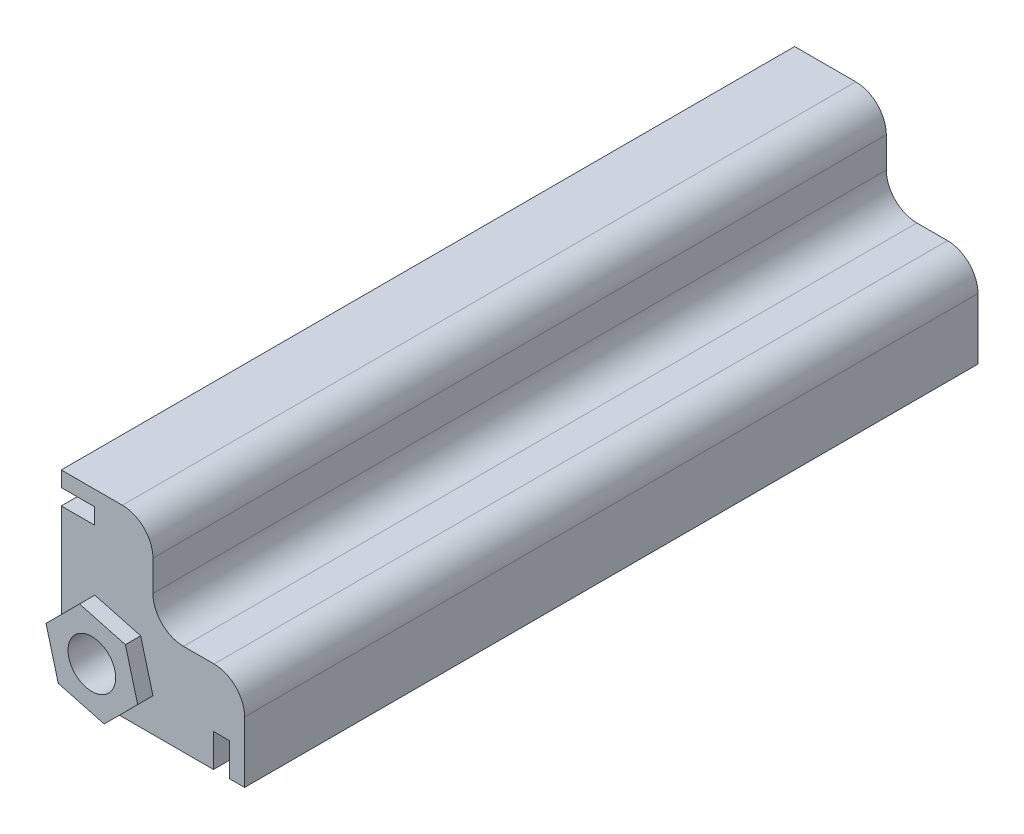
ISO-10303-21;
HEADER;
FILE_DESCRIPTION(('STEP AP214'),'2;1');
FILE_NAME('part.step','',(''),(''),'','','');
FILE_SCHEMA(('AUTOMOTIVE_DESIGN { 1 0 10303 214 1 1 1 1 }'));
ENDSEC;
DATA;
#1=APPLICATION_CONTEXT('core data for automotive mechanical design processes');
#2=APPLICATION_PROTOCOL_DEFINITION('international standard','automotive_design',2000,#1);
#3=PRODUCT_CONTEXT('',#1,'mechanical');
#4=PRODUCT('Part','Part','',(#3));
#5=PRODUCT_RELATED_PRODUCT_CATEGORY('part','',(#4));
#6=PRODUCT_DEFINITION_FORMATION('','',#4);
#7=PRODUCT_DEFINITION_CONTEXT('part definition',#1,'design');
#8=PRODUCT_DEFINITION('design','',#6,#7);
#9=PRODUCT_DEFINITION_SHAPE('','',#8);
#10=(LENGTH_UNIT() NAMED_UNIT(*) SI_UNIT(.MILLI.,.METRE.));
#11=(NAMED_UNIT(*) PLANE_ANGLE_UNIT() SI_UNIT($,.RADIAN.));
#12=(NAMED_UNIT(*) SI_UNIT($,.STERADIAN.) SOLID_ANGLE_UNIT());
#13=UNCERTAINTY_MEASURE_WITH_UNIT(LENGTH_MEASURE(1.E-05),#10,'distance_accuracy_value','');
#14=(GEOMETRIC_REPRESENTATION_CONTEXT(3) GLOBAL_UNCERTAINTY_ASSIGNED_CONTEXT((#13)) GLOBAL_UNIT_ASSIGNED_CONTEXT((#10,
#11,#12)) REPRESENTATION_CONTEXT('',''));
#15=CARTESIAN_POINT('',(0.,0.,0.));
#16=DIRECTION('',(0.,0.,1.));
#17=DIRECTION('',(1.,0.,0.));
#18=AXIS2_PLACEMENT_3D('',#15,#16,#17);
#19=CARTESIAN_POINT('',(0.,0.,152.4));
#20=DIRECTION('',(0.,0.,-1.));
#21=DIRECTION('',(-1.,0.,0.));
#22=AXIS2_PLACEMENT_3D('',#19,#20,#21);
#23=PLANE('',#22);
#24=DIRECTION('',(0.,1.,0.));
#25=VECTOR('',#24,1.);
#26=CARTESIAN_POINT('',(38.1,19.05,152.4));
#27=LINE('',#26,#25);
#28=CARTESIAN_POINT('',(38.1,0.,152.4));
#29=VERTEX_POINT('',#28);
#30=CARTESIAN_POINT('',(38.1,12.7,152.4));
#31=VERTEX_POINT('',#30);
#32=EDGE_CURVE('E309',#29,#31,#27,.T.);
#33=ORIENTED_EDGE('',*,*,#32,.T.);
#34=CARTESIAN_POINT('',(31.75,12.7,152.4));
#35=DIRECTION('',(0.,0.,-1.));
#36=DIRECTION('',(-1.,0.,0.));
#37=AXIS2_PLACEMENT_3D('',#34,#35,#36);
#38=CIRCLE('',#37,6.35);
#39=CARTESIAN_POINT('',(31.75,19.05,152.4));
#40=VERTEX_POINT('',#39);
#41=EDGE_CURVE('E389',#31,#40,#38,.F.);
#42=ORIENTED_EDGE('',*,*,#41,.T.);
#43=DIRECTION('',(-1.,0.,0.));
#44=VECTOR('',#43,1.);
#45=CARTESIAN_POINT('',(19.05,19.05,152.4));
#46=LINE('',#45,#44);
#47=CARTESIAN_POINT('',(25.4,19.05,152.4));
#48=VERTEX_POINT('',#47);
#49=EDGE_CURVE('E314',#40,#48,#46,.T.);
#50=ORIENTED_EDGE('',*,*,#49,.T.);
#51=CARTESIAN_POINT('',(25.4,25.4,152.4));
#52=DIRECTION('',(0.,0.,-1.));
#53=DIRECTION('',(-1.,0.,0.));
#54=AXIS2_PLACEMENT_3D('',#51,#52,#53);
#55=CIRCLE('',#54,6.35);
#56=CARTESIAN_POINT('',(19.05,25.4,152.4));
#57=VERTEX_POINT('',#56);
#58=EDGE_CURVE('E11',#48,#57,#55,.T.);
#59=ORIENTED_EDGE('',*,*,#58,.T.);
#60=DIRECTION('',(0.,1.,0.));
#61=VECTOR('',#60,1.);
#62=CARTESIAN_POINT('',(19.05,38.1,152.4));
#63=LINE('',#62,#61);
#64=CARTESIAN_POINT('',(19.05,31.75,152.4));
#65=VERTEX_POINT('',#64);
#66=EDGE_CURVE('E318',#57,#65,#63,.T.);
#67=ORIENTED_EDGE('',*,*,#66,.T.);
#68=CARTESIAN_POINT('',(12.7,31.75,152.4));
#69=DIRECTION('',(0.,0.,-1.));
#70=DIRECTION('',(-1.,0.,0.));
#71=AXIS2_PLACEMENT_3D('',#68,#69,#70);
#72=CIRCLE('',#71,6.35);
#73=CARTESIAN_POINT('',(12.7,38.1,152.4));
#74=VERTEX_POINT('',#73);
#75=EDGE_CURVE('E55',#65,#74,#72,.F.);
#76=ORIENTED_EDGE('',*,*,#75,.T.);
#77=DIRECTION('',(-1.,0.,0.));
#78=VECTOR('',#77,1.);
#79=CARTESIAN_POINT('',(0.,38.1,152.4));
#80=LINE('',#79,#78);
#81=CARTESIAN_POINT('',(0.,38.1,152.4));
#82=VERTEX_POINT('',#81);
#83=EDGE_CURVE('E321',#74,#82,#80,.T.);
#84=ORIENTED_EDGE('',*,*,#83,.T.);
#85=DIRECTION('',(0.,-1.,0.));
#86=VECTOR('',#85,1.);
#87=CARTESIAN_POINT('',(0.,0.,152.4));
#88=LINE('',#87,#86);
#89=CARTESIAN_POINT('',(0.,34.925,152.4));
#90=VERTEX_POINT('',#89);
#91=EDGE_CURVE('E325',#82,#90,#88,.T.);
#92=ORIENTED_EDGE('',*,*,#91,.T.);
#93=DIRECTION('',(-1.,0.,0.));
#94=VECTOR('',#93,1.);
#95=CARTESIAN_POINT('',(0.,34.925,152.4));
#96=LINE('',#95,#94);
#97=CARTESIAN_POINT('',(6.858,34.925,152.4));
#98=VERTEX_POINT('',#97);
#99=EDGE_CURVE('E241',#98,#90,#96,.T.);
#100=ORIENTED_EDGE('',*,*,#99,.F.);
#101=DIRECTION('',(0.,1.,0.));
#102=VECTOR('',#101,1.);
#103=CARTESIAN_POINT('',(6.858,34.925,152.4));
#104=LINE('',#103,#102);
#105=CARTESIAN_POINT('',(6.858,31.623,152.4));
#106=VERTEX_POINT('',#105);
#107=EDGE_CURVE('E254',#106,#98,#104,.T.);
#108=ORIENTED_EDGE('',*,*,#107,.F.);
#109=DIRECTION('',(1.,0.,0.));
#110=VECTOR('',#109,1.);
#111=CARTESIAN_POINT('',(0.,31.623,152.4));
#112=LINE('',#111,#110);
#113=CARTESIAN_POINT('',(0.,31.623,152.4));
#114=VERTEX_POINT('',#113);
#115=EDGE_CURVE('E250',#114,#106,#112,.T.);
#116=ORIENTED_EDGE('',*,*,#115,.F.);
#117=CARTESIAN_POINT('',(0.,12.0772160579064,152.4));
#118=VERTEX_POINT('',#117);
#119=EDGE_CURVE('E330',#114,#118,#88,.T.);
#120=ORIENTED_EDGE('',*,*,#119,.T.);
#121=DIRECTION('',(-0.707106781186547,-0.707106781186548,0.));
#122=VECTOR('',#121,1.);
#123=CARTESIAN_POINT('',(6.97278394209356,19.05,152.4));
#124=LINE('',#123,#122);
#125=CARTESIAN_POINT('',(6.97278394209356,19.05,152.4));
#126=VERTEX_POINT('',#125);
#127=EDGE_CURVE('E735',#126,#118,#124,.T.);
#128=ORIENTED_EDGE('',*,*,#127,.F.);
#129=DIRECTION('',(-0.965925826289068,0.258819045102521,0.));
#130=VECTOR('',#129,1.);
#131=CARTESIAN_POINT('',(16.4977839420936,16.4977839420936,152.4));
#132=LINE('',#131,#130);
#133=CARTESIAN_POINT('',(16.4977839420936,16.4977839420936,152.4));
#134=VERTEX_POINT('',#133);
#135=EDGE_CURVE('E732',#134,#126,#132,.T.);
#136=ORIENTED_EDGE('',*,*,#135,.F.);
#137=DIRECTION('',(-0.258819045102521,0.965925826289068,0.));
#138=VECTOR('',#137,1.);
#139=CARTESIAN_POINT('',(19.05,6.97278394209356,152.4));
#140=LINE('',#139,#138);
#141=CARTESIAN_POINT('',(19.05,6.97278394209356,152.4));
#142=VERTEX_POINT('',#141);
#143=EDGE_CURVE('E223',#142,#134,#140,.T.);
#144=ORIENTED_EDGE('',*,*,#143,.F.);
#145=DIRECTION('',(0.707106781186547,0.707106781186548,0.));
#146=VECTOR('',#145,1.);
#147=CARTESIAN_POINT('',(12.0772160579064,0.,152.4));
#148=LINE('',#147,#146);
#149=CARTESIAN_POINT('',(12.0772160579065,0.,152.4));
#150=VERTEX_POINT('',#149);
#151=EDGE_CURVE('E220',#150,#142,#148,.T.);
#152=ORIENTED_EDGE('',*,*,#151,.F.);
#153=DIRECTION('',(1.,0.,0.));
#154=VECTOR('',#153,1.);
#155=CARTESIAN_POINT('',(38.1,0.,152.4));
#156=LINE('',#155,#154);
#157=CARTESIAN_POINT('',(31.623,0.,152.4));
#158=VERTEX_POINT('',#157);
#159=EDGE_CURVE('E310',#150,#158,#156,.T.);
#160=ORIENTED_EDGE('',*,*,#159,.T.);
#161=DIRECTION('',(0.,-1.,0.));
#162=VECTOR('',#161,1.);
#163=CARTESIAN_POINT('',(31.623,0.,152.4));
#164=LINE('',#163,#162);
#165=CARTESIAN_POINT('',(31.623,6.858,152.4));
#166=VERTEX_POINT('',#165);
#167=EDGE_CURVE('E279',#166,#158,#164,.T.);
#168=ORIENTED_EDGE('',*,*,#167,.F.);
#169=DIRECTION('',(-1.,0.,0.));
#170=VECTOR('',#169,1.);
#171=CARTESIAN_POINT('',(34.925,6.858,152.4));
#172=LINE('',#171,#170);
#173=CARTESIAN_POINT('',(34.925,6.858,152.4));
#174=VERTEX_POINT('',#173);
#175=EDGE_CURVE('E230',#174,#166,#172,.T.);
#176=ORIENTED_EDGE('',*,*,#175,.F.);
#177=DIRECTION('',(0.,1.,0.));
#178=VECTOR('',#177,1.);
#179=CARTESIAN_POINT('',(34.925,0.,152.4));
#180=LINE('',#179,#178);
#181=CARTESIAN_POINT('',(34.925,0.,152.4));
#182=VERTEX_POINT('',#181);
#183=EDGE_CURVE('E225',#182,#174,#180,.T.);
#184=ORIENTED_EDGE('',*,*,#183,.F.);
#185=EDGE_CURVE('E311',#182,#29,#156,.T.);
#186=ORIENTED_EDGE('',*,*,#185,.T.);
#187=EDGE_LOOP('',(#33,#42,#50,#59,#67,#76,#84,#92,#100,#108,#116,#120,#128,#136,#144,#152,#160,
#168,#176,#184,#186));
#188=FACE_BOUND('',#187,.T.);
#189=ADVANCED_FACE('F39',(#188),#23,.F.);
#190=DIRECTION('',(0.965925826289068,-0.258819045102521,0.));
#191=VECTOR('',#190,1.);
#192=CARTESIAN_POINT('',(2.55221605790646,2.55221605790644,152.4));
#193=LINE('',#192,#191);
#194=CARTESIAN_POINT('',(2.55221605790646,2.55221605790644,152.4));
#195=VERTEX_POINT('',#194);
#196=EDGE_CURVE('E740',#195,#150,#193,.T.);
#197=ORIENTED_EDGE('',*,*,#196,.F.);
#198=DIRECTION('',(0.258819045102521,-0.965925826289068,0.));
#199=VECTOR('',#198,1.);
#200=CARTESIAN_POINT('',(0.,12.0772160579064,152.4));
#201=LINE('',#200,#199);
#202=EDGE_CURVE('E450',#118,#195,#201,.T.);
#203=ORIENTED_EDGE('',*,*,#202,.F.);
#204=CARTESIAN_POINT('',(0.,0.,152.4));
#205=VERTEX_POINT('',#204);
#206=EDGE_CURVE('E324',#118,#205,#88,.T.);
#207=ORIENTED_EDGE('',*,*,#206,.T.);
#208=EDGE_CURVE('E305',#205,#150,#156,.T.);
#209=ORIENTED_EDGE('',*,*,#208,.T.);
#210=EDGE_LOOP('',(#197,#203,#207,#209));
#211=FACE_BOUND('',#210,.T.);
#212=ADVANCED_FACE('F446',(#211),#23,.F.);
#213=CARTESIAN_POINT('',(38.1,0.,152.4));
#214=DIRECTION('',(0.,1.,0.));
#215=DIRECTION('',(-1.,0.,0.));
#216=AXIS2_PLACEMENT_3D('',#213,#214,#215);
#217=PLANE('',#216);
#218=ORIENTED_EDGE('',*,*,#185,.F.);
#219=DIRECTION('',(0.,0.,1.));
#220=VECTOR('',#219,1.);
#221=CARTESIAN_POINT('',(34.925,0.,0.));
#222=LINE('',#221,#220);
#223=CARTESIAN_POINT('',(34.925,0.,0.));
#224=VERTEX_POINT('',#223);
#225=EDGE_CURVE('E255',#224,#182,#222,.T.);
#226=ORIENTED_EDGE('',*,*,#225,.F.);
#227=DIRECTION('',(1.,0.,0.));
#228=VECTOR('',#227,1.);
#229=CARTESIAN_POINT('',(38.1,0.,0.));
#230=LINE('',#229,#228);
#231=CARTESIAN_POINT('',(38.1,0.,0.));
#232=VERTEX_POINT('',#231);
#233=EDGE_CURVE('E265',#224,#232,#230,.T.);
#234=ORIENTED_EDGE('',*,*,#233,.T.);
#235=DIRECTION('',(0.,0.,-1.));
#236=VECTOR('',#235,1.);
#237=CARTESIAN_POINT('',(38.1,0.,152.4));
#238=LINE('',#237,#236);
#239=EDGE_CURVE('E361',#29,#232,#238,.T.);
#240=ORIENTED_EDGE('',*,*,#239,.F.);
#241=EDGE_LOOP('',(#218,#226,#234,#240));
#242=FACE_BOUND('',#241,.T.);
#243=ADVANCED_FACE('F466',(#242),#217,.F.);
#244=CARTESIAN_POINT('',(0.,0.,152.4));
#245=DIRECTION('',(1.,0.,0.));
#246=DIRECTION('',(0.,0.,-1.));
#247=AXIS2_PLACEMENT_3D('',#244,#245,#246);
#248=PLANE('',#247);
#249=DIRECTION('',(0.,-1.,0.));
#250=VECTOR('',#249,1.);
#251=CARTESIAN_POINT('',(0.,0.,0.));
#252=LINE('',#251,#250);
#253=CARTESIAN_POINT('',(0.,38.1,0.));
#254=VERTEX_POINT('',#253);
#255=CARTESIAN_POINT('',(0.,34.925,0.));
#256=VERTEX_POINT('',#255);
#257=EDGE_CURVE('E350',#254,#256,#252,.T.);
#258=ORIENTED_EDGE('',*,*,#257,.T.);
#259=DIRECTION('',(0.,0.,1.));
#260=VECTOR('',#259,1.);
#261=CARTESIAN_POINT('',(0.,34.925,0.));
#262=LINE('',#261,#260);
#263=EDGE_CURVE('E261',#256,#90,#262,.T.);
#264=ORIENTED_EDGE('',*,*,#263,.T.);
#265=ORIENTED_EDGE('',*,*,#91,.F.);
#266=DIRECTION('',(0.,0.,-1.));
#267=VECTOR('',#266,1.);
#268=CARTESIAN_POINT('',(0.,38.1,152.4));
#269=LINE('',#268,#267);
#270=EDGE_CURVE('E357',#82,#254,#269,.T.);
#271=ORIENTED_EDGE('',*,*,#270,.T.);
#272=EDGE_LOOP('',(#258,#264,#265,#271));
#273=FACE_BOUND('',#272,.T.);
#274=ADVANCED_FACE('F422',(#273),#248,.F.);
#275=CARTESIAN_POINT('',(0.,0.,0.));
#276=VERTEX_POINT('',#275);
#277=CARTESIAN_POINT('',(31.623,0.,0.));
#278=VERTEX_POINT('',#277);
#279=EDGE_CURVE('E331',#276,#278,#230,.T.);
#280=ORIENTED_EDGE('',*,*,#279,.T.);
#281=DIRECTION('',(0.,0.,1.));
#282=VECTOR('',#281,1.);
#283=CARTESIAN_POINT('',(31.623,0.,0.));
#284=LINE('',#283,#282);
#285=EDGE_CURVE('E296',#278,#158,#284,.T.);
#286=ORIENTED_EDGE('',*,*,#285,.T.);
#287=ORIENTED_EDGE('',*,*,#159,.F.);
#288=ORIENTED_EDGE('',*,*,#208,.F.);
#289=DIRECTION('',(0.,0.,-1.));
#290=VECTOR('',#289,1.);
#291=CARTESIAN_POINT('',(0.,0.,152.4));
#292=LINE('',#291,#290);
#293=EDGE_CURVE('E329',#205,#276,#292,.T.);
#294=ORIENTED_EDGE('',*,*,#293,.T.);
#295=EDGE_LOOP('',(#280,#286,#287,#288,#294));
#296=FACE_BOUND('',#295,.T.);
#297=ADVANCED_FACE('F454',(#296),#217,.F.);
#298=CARTESIAN_POINT('',(38.1,19.05,152.4));
#299=DIRECTION('',(-1.,0.,0.));
#300=DIRECTION('',(0.,-1.,0.));
#301=AXIS2_PLACEMENT_3D('',#298,#299,#300);
#302=PLANE('',#301);
#303=DIRECTION('',(0.,1.,0.));
#304=VECTOR('',#303,1.);
#305=CARTESIAN_POINT('',(38.1,19.05,0.));
#306=LINE('',#305,#304);
#307=CARTESIAN_POINT('',(38.1,12.7,0.));
#308=VERTEX_POINT('',#307);
#309=EDGE_CURVE('E335',#232,#308,#306,.T.);
#310=ORIENTED_EDGE('',*,*,#309,.T.);
#311=DIRECTION('',(0.,0.,-1.));
#312=VECTOR('',#311,1.);
#313=CARTESIAN_POINT('',(38.1,12.7,152.4));
#314=LINE('',#313,#312);
#315=EDGE_CURVE('E63',#308,#31,#314,.F.);
#316=ORIENTED_EDGE('',*,*,#315,.T.);
#317=ORIENTED_EDGE('',*,*,#32,.F.);
#318=ORIENTED_EDGE('',*,*,#239,.T.);
#319=EDGE_LOOP('',(#310,#316,#317,#318));
#320=FACE_BOUND('',#319,.T.);
#321=ADVANCED_FACE('F465',(#320),#302,.F.);
#322=CARTESIAN_POINT('',(19.05,19.05,152.4));
#323=DIRECTION('',(0.,-1.,0.));
#324=DIRECTION('',(0.,0.,-1.));
#325=AXIS2_PLACEMENT_3D('',#322,#323,#324);
#326=PLANE('',#325);
#327=DIRECTION('',(-1.,0.,0.));
#328=VECTOR('',#327,1.);
#329=CARTESIAN_POINT('',(19.05,19.05,0.));
#330=LINE('',#329,#328);
#331=CARTESIAN_POINT('',(31.75,19.05,0.));
#332=VERTEX_POINT('',#331);
#333=CARTESIAN_POINT('',(25.4,19.05,0.));
#334=VERTEX_POINT('',#333);
#335=EDGE_CURVE('E338',#332,#334,#330,.T.);
#336=ORIENTED_EDGE('',*,*,#335,.T.);
#337=DIRECTION('',(0.,0.,-1.));
#338=VECTOR('',#337,1.);
#339=CARTESIAN_POINT('',(25.4,19.05,152.4));
#340=LINE('',#339,#338);
#341=EDGE_CURVE('E376',#334,#48,#340,.F.);
#342=ORIENTED_EDGE('',*,*,#341,.T.);
#343=ORIENTED_EDGE('',*,*,#49,.F.);
#344=DIRECTION('',(0.,0.,-1.));
#345=VECTOR('',#344,1.);
#346=CARTESIAN_POINT('',(31.75,19.05,152.4));
#347=LINE('',#346,#345);
#348=EDGE_CURVE('E372',#40,#332,#347,.T.);
#349=ORIENTED_EDGE('',*,*,#348,.T.);
#350=EDGE_LOOP('',(#336,#342,#343,#349));
#351=FACE_BOUND('',#350,.T.);
#352=ADVANCED_FACE('F404',(#351),#326,.F.);
#353=CARTESIAN_POINT('',(19.05,38.1,152.4));
#354=DIRECTION('',(-1.,0.,0.));
#355=DIRECTION('',(0.,-1.,0.));
#356=AXIS2_PLACEMENT_3D('',#353,#354,#355);
#357=PLANE('',#356);
#358=ORIENTED_EDGE('',*,*,#66,.F.);
#359=DIRECTION('',(0.,0.,-1.));
#360=VECTOR('',#359,1.);
#361=CARTESIAN_POINT('',(19.05,25.4,0.));
#362=LINE('',#361,#360);
#363=CARTESIAN_POINT('',(19.05,25.4,0.));
#364=VERTEX_POINT('',#363);
#365=EDGE_CURVE('E368',#57,#364,#362,.T.);
#366=ORIENTED_EDGE('',*,*,#365,.T.);
#367=DIRECTION('',(0.,1.,0.));
#368=VECTOR('',#367,1.);
#369=CARTESIAN_POINT('',(19.05,38.1,0.));
#370=LINE('',#369,#368);
#371=CARTESIAN_POINT('',(19.05,31.75,0.));
#372=VERTEX_POINT('',#371);
#373=EDGE_CURVE('E342',#364,#372,#370,.T.);
#374=ORIENTED_EDGE('',*,*,#373,.T.);
#375=DIRECTION('',(0.,0.,-1.));
#376=VECTOR('',#375,1.);
#377=CARTESIAN_POINT('',(19.05,31.75,152.4));
#378=LINE('',#377,#376);
#379=EDGE_CURVE('E365',#372,#65,#378,.F.);
#380=ORIENTED_EDGE('',*,*,#379,.T.);
#381=EDGE_LOOP('',(#358,#366,#374,#380));
#382=FACE_BOUND('',#381,.T.);
#383=ADVANCED_FACE('F411',(#382),#357,.F.);
#384=CARTESIAN_POINT('',(0.,38.1,152.4));
#385=DIRECTION('',(0.,-1.,0.));
#386=DIRECTION('',(0.,0.,-1.));
#387=AXIS2_PLACEMENT_3D('',#384,#385,#386);
#388=PLANE('',#387);
#389=ORIENTED_EDGE('',*,*,#83,.F.);
#390=DIRECTION('',(0.,0.,-1.));
#391=VECTOR('',#390,1.);
#392=CARTESIAN_POINT('',(12.7,38.1,152.4));
#393=LINE('',#392,#391);
#394=CARTESIAN_POINT('',(12.7,38.1,0.));
#395=VERTEX_POINT('',#394);
#396=EDGE_CURVE('E392',#74,#395,#393,.T.);
#397=ORIENTED_EDGE('',*,*,#396,.T.);
#398=DIRECTION('',(-1.,0.,0.));
#399=VECTOR('',#398,1.);
#400=CARTESIAN_POINT('',(0.,38.1,0.));
#401=LINE('',#400,#399);
#402=EDGE_CURVE('E346',#395,#254,#401,.T.);
#403=ORIENTED_EDGE('',*,*,#402,.T.);
#404=ORIENTED_EDGE('',*,*,#270,.F.);
#405=EDGE_LOOP('',(#389,#397,#403,#404));
#406=FACE_BOUND('',#405,.T.);
#407=ADVANCED_FACE('F417',(#406),#388,.F.);
#408=ORIENTED_EDGE('',*,*,#119,.F.);
#409=DIRECTION('',(0.,0.,1.));
#410=VECTOR('',#409,1.);
#411=CARTESIAN_POINT('',(0.,31.623,0.));
#412=LINE('',#411,#410);
#413=CARTESIAN_POINT('',(0.,31.623,0.));
#414=VERTEX_POINT('',#413);
#415=EDGE_CURVE('E249',#414,#114,#412,.T.);
#416=ORIENTED_EDGE('',*,*,#415,.F.);
#417=EDGE_CURVE('E349',#414,#276,#252,.T.);
#418=ORIENTED_EDGE('',*,*,#417,.T.);
#419=ORIENTED_EDGE('',*,*,#293,.F.);
#420=ORIENTED_EDGE('',*,*,#206,.F.);
#421=EDGE_LOOP('',(#408,#416,#418,#419,#420));
#422=FACE_BOUND('',#421,.T.);
#423=ADVANCED_FACE('F440',(#422),#248,.F.);
#424=CARTESIAN_POINT('',(0.,0.,0.));
#425=DIRECTION('',(0.,0.,-1.));
#426=DIRECTION('',(-1.,0.,0.));
#427=AXIS2_PLACEMENT_3D('',#424,#425,#426);
#428=PLANE('',#427);
#429=CARTESIAN_POINT('',(9.525,9.525,0.));
#430=DIRECTION('',(0.,0.,1.));
#431=DIRECTION('',(1.,0.,0.));
#432=AXIS2_PLACEMENT_3D('',#429,#430,#431);
#433=CIRCLE('',#432,4.953);
#434=CARTESIAN_POINT('',(14.478,9.525,0.));
#435=VERTEX_POINT('',#434);
#436=EDGE_CURVE('E710',#435,#435,#433,.T.);
#437=ORIENTED_EDGE('',*,*,#436,.T.);
#438=EDGE_LOOP('',(#437));
#439=FACE_BOUND('',#438,.T.);
#440=ORIENTED_EDGE('',*,*,#335,.F.);
#441=CARTESIAN_POINT('',(31.75,12.7,0.));
#442=DIRECTION('',(0.,0.,-1.));
#443=DIRECTION('',(-1.,0.,0.));
#444=AXIS2_PLACEMENT_3D('',#441,#442,#443);
#445=CIRCLE('',#444,6.35);
#446=EDGE_CURVE('E382',#332,#308,#445,.T.);
#447=ORIENTED_EDGE('',*,*,#446,.T.);
#448=ORIENTED_EDGE('',*,*,#309,.F.);
#449=ORIENTED_EDGE('',*,*,#233,.F.);
#450=DIRECTION('',(0.,1.,0.));
#451=VECTOR('',#450,1.);
#452=CARTESIAN_POINT('',(34.925,0.,0.));
#453=LINE('',#452,#451);
#454=CARTESIAN_POINT('',(34.925,6.858,0.));
#455=VERTEX_POINT('',#454);
#456=EDGE_CURVE('E274',#224,#455,#453,.T.);
#457=ORIENTED_EDGE('',*,*,#456,.T.);
#458=DIRECTION('',(-1.,0.,0.));
#459=VECTOR('',#458,1.);
#460=CARTESIAN_POINT('',(34.925,6.858,0.));
#461=LINE('',#460,#459);
#462=CARTESIAN_POINT('',(31.623,6.858,0.));
#463=VERTEX_POINT('',#462);
#464=EDGE_CURVE('E278',#455,#463,#461,.T.);
#465=ORIENTED_EDGE('',*,*,#464,.T.);
#466=DIRECTION('',(0.,-1.,0.));
#467=VECTOR('',#466,1.);
#468=CARTESIAN_POINT('',(31.623,0.,0.));
#469=LINE('',#468,#467);
#470=EDGE_CURVE('E283',#463,#278,#469,.T.);
#471=ORIENTED_EDGE('',*,*,#470,.T.);
#472=ORIENTED_EDGE('',*,*,#279,.F.);
#473=ORIENTED_EDGE('',*,*,#417,.F.);
#474=DIRECTION('',(1.,0.,0.));
#475=VECTOR('',#474,1.);
#476=CARTESIAN_POINT('',(0.,31.623,0.));
#477=LINE('',#476,#475);
#478=CARTESIAN_POINT('',(6.858,31.623,0.));
#479=VERTEX_POINT('',#478);
#480=EDGE_CURVE('E236',#414,#479,#477,.T.);
#481=ORIENTED_EDGE('',*,*,#480,.T.);
#482=DIRECTION('',(0.,1.,0.));
#483=VECTOR('',#482,1.);
#484=CARTESIAN_POINT('',(6.858,34.925,0.));
#485=LINE('',#484,#483);
#486=CARTESIAN_POINT('',(6.858,34.925,0.));
#487=VERTEX_POINT('',#486);
#488=EDGE_CURVE('E240',#479,#487,#485,.T.);
#489=ORIENTED_EDGE('',*,*,#488,.T.);
#490=DIRECTION('',(-1.,0.,0.));
#491=VECTOR('',#490,1.);
#492=CARTESIAN_POINT('',(0.,34.925,0.));
#493=LINE('',#492,#491);
#494=EDGE_CURVE('E245',#487,#256,#493,.T.);
#495=ORIENTED_EDGE('',*,*,#494,.T.);
#496=ORIENTED_EDGE('',*,*,#257,.F.);
#497=ORIENTED_EDGE('',*,*,#402,.F.);
#498=CARTESIAN_POINT('',(12.7,31.75,0.));
#499=DIRECTION('',(0.,0.,-1.));
#500=DIRECTION('',(-1.,0.,0.));
#501=AXIS2_PLACEMENT_3D('',#498,#499,#500);
#502=CIRCLE('',#501,6.35);
#503=EDGE_CURVE('E379',#395,#372,#502,.T.);
#504=ORIENTED_EDGE('',*,*,#503,.T.);
#505=ORIENTED_EDGE('',*,*,#373,.F.);
#506=CARTESIAN_POINT('',(25.4,25.4,0.));
#507=DIRECTION('',(0.,0.,-1.));
#508=DIRECTION('',(-1.,0.,0.));
#509=AXIS2_PLACEMENT_3D('',#506,#507,#508);
#510=CIRCLE('',#509,6.35);
#511=EDGE_CURVE('E48',#364,#334,#510,.F.);
#512=ORIENTED_EDGE('',*,*,#511,.T.);
#513=EDGE_LOOP('',(#440,#447,#448,#449,#457,#465,#471,#472,#473,#481,#489,#495,#496,#497,#504,
#505,#512));
#514=FACE_BOUND('',#513,.T.);
#515=ADVANCED_FACE('F399',(#439,#514),#428,.T.);
#516=CARTESIAN_POINT('',(34.925,0.,0.));
#517=DIRECTION('',(1.,0.,0.));
#518=DIRECTION('',(0.,0.,-1.));
#519=AXIS2_PLACEMENT_3D('',#516,#517,#518);
#520=PLANE('',#519);
#521=ORIENTED_EDGE('',*,*,#183,.T.);
#522=DIRECTION('',(0.,0.,1.));
#523=VECTOR('',#522,1.);
#524=CARTESIAN_POINT('',(34.925,6.858,0.));
#525=LINE('',#524,#523);
#526=EDGE_CURVE('E286',#455,#174,#525,.T.);
#527=ORIENTED_EDGE('',*,*,#526,.F.);
#528=ORIENTED_EDGE('',*,*,#456,.F.);
#529=ORIENTED_EDGE('',*,*,#225,.T.);
#530=EDGE_LOOP('',(#521,#527,#528,#529));
#531=FACE_BOUND('',#530,.T.);
#532=ADVANCED_FACE('F486',(#531),#520,.F.);
#533=CARTESIAN_POINT('',(31.623,0.,0.));
#534=DIRECTION('',(-1.,0.,0.));
#535=DIRECTION('',(0.,0.,1.));
#536=AXIS2_PLACEMENT_3D('',#533,#534,#535);
#537=PLANE('',#536);
#538=ORIENTED_EDGE('',*,*,#167,.T.);
#539=ORIENTED_EDGE('',*,*,#285,.F.);
#540=ORIENTED_EDGE('',*,*,#470,.F.);
#541=DIRECTION('',(0.,0.,1.));
#542=VECTOR('',#541,1.);
#543=CARTESIAN_POINT('',(31.623,6.858,0.));
#544=LINE('',#543,#542);
#545=EDGE_CURVE('E300',#463,#166,#544,.T.);
#546=ORIENTED_EDGE('',*,*,#545,.T.);
#547=EDGE_LOOP('',(#538,#539,#540,#546));
#548=FACE_BOUND('',#547,.T.);
#549=ADVANCED_FACE('F524',(#548),#537,.F.);
#550=CARTESIAN_POINT('',(34.925,6.858,0.));
#551=DIRECTION('',(0.,1.,0.));
#552=DIRECTION('',(-1.,0.,0.));
#553=AXIS2_PLACEMENT_3D('',#550,#551,#552);
#554=PLANE('',#553);
#555=ORIENTED_EDGE('',*,*,#175,.T.);
#556=ORIENTED_EDGE('',*,*,#545,.F.);
#557=ORIENTED_EDGE('',*,*,#464,.F.);
#558=ORIENTED_EDGE('',*,*,#526,.T.);
#559=EDGE_LOOP('',(#555,#556,#557,#558));
#560=FACE_BOUND('',#559,.T.);
#561=ADVANCED_FACE('F533',(#560),#554,.F.);
#562=CARTESIAN_POINT('',(0.,34.925,0.));
#563=DIRECTION('',(0.,1.,0.));
#564=DIRECTION('',(0.,0.,1.));
#565=AXIS2_PLACEMENT_3D('',#562,#563,#564);
#566=PLANE('',#565);
#567=ORIENTED_EDGE('',*,*,#99,.T.);
#568=ORIENTED_EDGE('',*,*,#263,.F.);
#569=ORIENTED_EDGE('',*,*,#494,.F.);
#570=DIRECTION('',(0.,0.,1.));
#571=VECTOR('',#570,1.);
#572=CARTESIAN_POINT('',(6.858,34.925,0.));
#573=LINE('',#572,#571);
#574=EDGE_CURVE('E266',#487,#98,#573,.T.);
#575=ORIENTED_EDGE('',*,*,#574,.T.);
#576=EDGE_LOOP('',(#567,#568,#569,#575));
#577=FACE_BOUND('',#576,.T.);
#578=ADVANCED_FACE('F428',(#577),#566,.F.);
#579=CARTESIAN_POINT('',(6.858,34.925,0.));
#580=DIRECTION('',(1.,0.,0.));
#581=DIRECTION('',(0.,1.,0.));
#582=AXIS2_PLACEMENT_3D('',#579,#580,#581);
#583=PLANE('',#582);
#584=ORIENTED_EDGE('',*,*,#107,.T.);
#585=ORIENTED_EDGE('',*,*,#574,.F.);
#586=ORIENTED_EDGE('',*,*,#488,.F.);
#587=DIRECTION('',(0.,0.,1.));
#588=VECTOR('',#587,1.);
#589=CARTESIAN_POINT('',(6.858,31.623,0.));
#590=LINE('',#589,#588);
#591=EDGE_CURVE('E269',#479,#106,#590,.T.);
#592=ORIENTED_EDGE('',*,*,#591,.T.);
#593=EDGE_LOOP('',(#584,#585,#586,#592));
#594=FACE_BOUND('',#593,.T.);
#595=ADVANCED_FACE('F430',(#594),#583,.F.);
#596=CARTESIAN_POINT('',(0.,31.623,0.));
#597=DIRECTION('',(0.,-1.,0.));
#598=DIRECTION('',(0.,0.,-1.));
#599=AXIS2_PLACEMENT_3D('',#596,#597,#598);
#600=PLANE('',#599);
#601=ORIENTED_EDGE('',*,*,#115,.T.);
#602=ORIENTED_EDGE('',*,*,#591,.F.);
#603=ORIENTED_EDGE('',*,*,#480,.F.);
#604=ORIENTED_EDGE('',*,*,#415,.T.);
#605=EDGE_LOOP('',(#601,#602,#603,#604));
#606=FACE_BOUND('',#605,.T.);
#607=ADVANCED_FACE('F433',(#606),#600,.F.);
#608=CARTESIAN_POINT('',(19.05,6.97278394209356,155.575));
#609=DIRECTION('',(-0.965925826289068,-0.258819045102521,0.));
#610=DIRECTION('',(0.258819045102521,-0.965925826289068,0.));
#611=AXIS2_PLACEMENT_3D('',#608,#609,#610);
#612=PLANE('',#611);
#613=ORIENTED_EDGE('',*,*,#143,.T.);
#614=DIRECTION('',(0.,0.,-1.));
#615=VECTOR('',#614,1.);
#616=CARTESIAN_POINT('',(16.4977839420936,16.4977839420936,155.575));
#617=LINE('',#616,#615);
#618=CARTESIAN_POINT('',(16.4977839420936,16.4977839420936,155.575));
#619=VERTEX_POINT('',#618);
#620=EDGE_CURVE('E202',#619,#134,#617,.T.);
#621=ORIENTED_EDGE('',*,*,#620,.F.);
#622=DIRECTION('',(-0.258819045102521,0.965925826289068,0.));
#623=VECTOR('',#622,1.);
#624=CARTESIAN_POINT('',(19.05,6.97278394209356,155.575));
#625=LINE('',#624,#623);
#626=CARTESIAN_POINT('',(19.05,6.97278394209356,155.575));
#627=VERTEX_POINT('',#626);
#628=EDGE_CURVE('E210',#627,#619,#625,.T.);
#629=ORIENTED_EDGE('',*,*,#628,.F.);
#630=DIRECTION('',(0.,0.,-1.));
#631=VECTOR('',#630,1.);
#632=CARTESIAN_POINT('',(19.05,6.97278394209356,155.575));
#633=LINE('',#632,#631);
#634=EDGE_CURVE('E729',#627,#142,#633,.T.);
#635=ORIENTED_EDGE('',*,*,#634,.T.);
#636=EDGE_LOOP('',(#613,#621,#629,#635));
#637=FACE_BOUND('',#636,.T.);
#638=ADVANCED_FACE('F222',(#637),#612,.F.);
#639=CARTESIAN_POINT('',(16.4977839420936,16.4977839420936,155.575));
#640=DIRECTION('',(-0.258819045102521,-0.965925826289068,0.));
#641=DIRECTION('',(0.965925826289068,-0.258819045102521,0.));
#642=AXIS2_PLACEMENT_3D('',#639,#640,#641);
#643=PLANE('',#642);
#644=ORIENTED_EDGE('',*,*,#135,.T.);
#645=DIRECTION('',(0.,0.,-1.));
#646=VECTOR('',#645,1.);
#647=CARTESIAN_POINT('',(6.97278394209356,19.05,155.575));
#648=LINE('',#647,#646);
#649=CARTESIAN_POINT('',(6.97278394209356,19.05,155.575));
#650=VERTEX_POINT('',#649);
#651=EDGE_CURVE('E205',#650,#126,#648,.T.);
#652=ORIENTED_EDGE('',*,*,#651,.F.);
#653=DIRECTION('',(-0.965925826289068,0.258819045102521,0.));
#654=VECTOR('',#653,1.);
#655=CARTESIAN_POINT('',(16.4977839420936,16.4977839420936,155.575));
#656=LINE('',#655,#654);
#657=EDGE_CURVE('E197',#619,#650,#656,.T.);
#658=ORIENTED_EDGE('',*,*,#657,.F.);
#659=ORIENTED_EDGE('',*,*,#620,.T.);
#660=EDGE_LOOP('',(#644,#652,#658,#659));
#661=FACE_BOUND('',#660,.T.);
#662=ADVANCED_FACE('F200',(#661),#643,.F.);
#663=CARTESIAN_POINT('',(6.97278394209356,19.05,155.575));
#664=DIRECTION('',(0.707106781186548,-0.707106781186547,0.));
#665=DIRECTION('',(0.707106781186547,0.707106781186548,0.));
#666=AXIS2_PLACEMENT_3D('',#663,#664,#665);
#667=PLANE('',#666);
#668=ORIENTED_EDGE('',*,*,#127,.T.);
#669=DIRECTION('',(0.,0.,-1.));
#670=VECTOR('',#669,1.);
#671=CARTESIAN_POINT('',(0.,12.0772160579064,155.575));
#672=LINE('',#671,#670);
#673=CARTESIAN_POINT('',(0.,12.0772160579064,155.575));
#674=VERTEX_POINT('',#673);
#675=EDGE_CURVE('E232',#674,#118,#672,.T.);
#676=ORIENTED_EDGE('',*,*,#675,.F.);
#677=DIRECTION('',(-0.707106781186547,-0.707106781186548,0.));
#678=VECTOR('',#677,1.);
#679=CARTESIAN_POINT('',(6.97278394209356,19.05,155.575));
#680=LINE('',#679,#678);
#681=EDGE_CURVE('E209',#650,#674,#680,.T.);
#682=ORIENTED_EDGE('',*,*,#681,.F.);
#683=ORIENTED_EDGE('',*,*,#651,.T.);
#684=EDGE_LOOP('',(#668,#676,#682,#683));
#685=FACE_BOUND('',#684,.T.);
#686=ADVANCED_FACE('F600',(#685),#667,.F.);
#687=CARTESIAN_POINT('',(0.,12.0772160579064,155.575));
#688=DIRECTION('',(0.965925826289068,0.258819045102521,0.));
#689=DIRECTION('',(-0.258819045102521,0.965925826289068,0.));
#690=AXIS2_PLACEMENT_3D('',#687,#688,#689);
#691=PLANE('',#690);
#692=ORIENTED_EDGE('',*,*,#202,.T.);
#693=DIRECTION('',(0.,0.,-1.));
#694=VECTOR('',#693,1.);
#695=CARTESIAN_POINT('',(2.55221605790646,2.55221605790644,155.575));
#696=LINE('',#695,#694);
#697=CARTESIAN_POINT('',(2.55221605790646,2.55221605790644,155.575));
#698=VERTEX_POINT('',#697);
#699=EDGE_CURVE('E752',#698,#195,#696,.T.);
#700=ORIENTED_EDGE('',*,*,#699,.F.);
#701=DIRECTION('',(0.258819045102521,-0.965925826289068,0.));
#702=VECTOR('',#701,1.);
#703=CARTESIAN_POINT('',(0.,12.0772160579064,155.575));
#704=LINE('',#703,#702);
#705=EDGE_CURVE('E721',#674,#698,#704,.T.);
#706=ORIENTED_EDGE('',*,*,#705,.F.);
#707=ORIENTED_EDGE('',*,*,#675,.T.);
#708=EDGE_LOOP('',(#692,#700,#706,#707));
#709=FACE_BOUND('',#708,.T.);
#710=ADVANCED_FACE('F609',(#709),#691,.F.);
#711=CARTESIAN_POINT('',(2.55221605790646,2.55221605790644,155.575));
#712=DIRECTION('',(0.258819045102521,0.965925826289068,0.));
#713=DIRECTION('',(-0.965925826289068,0.258819045102521,0.));
#714=AXIS2_PLACEMENT_3D('',#711,#712,#713);
#715=PLANE('',#714);
#716=ORIENTED_EDGE('',*,*,#196,.T.);
#717=DIRECTION('',(0.,0.,-1.));
#718=VECTOR('',#717,1.);
#719=CARTESIAN_POINT('',(12.0772160579064,0.,155.575));
#720=LINE('',#719,#718);
#721=CARTESIAN_POINT('',(12.0772160579064,0.,155.575));
#722=VERTEX_POINT('',#721);
#723=EDGE_CURVE('E748',#722,#150,#720,.T.);
#724=ORIENTED_EDGE('',*,*,#723,.F.);
#725=DIRECTION('',(0.965925826289068,-0.258819045102521,0.));
#726=VECTOR('',#725,1.);
#727=CARTESIAN_POINT('',(2.55221605790646,2.55221605790644,155.575));
#728=LINE('',#727,#726);
#729=EDGE_CURVE('E724',#698,#722,#728,.T.);
#730=ORIENTED_EDGE('',*,*,#729,.F.);
#731=ORIENTED_EDGE('',*,*,#699,.T.);
#732=EDGE_LOOP('',(#716,#724,#730,#731));
#733=FACE_BOUND('',#732,.T.);
#734=ADVANCED_FACE('F619',(#733),#715,.F.);
#735=CARTESIAN_POINT('',(12.0772160579064,0.,155.575));
#736=DIRECTION('',(-0.707106781186548,0.707106781186547,0.));
#737=DIRECTION('',(-0.707106781186547,-0.707106781186548,0.));
#738=AXIS2_PLACEMENT_3D('',#735,#736,#737);
#739=PLANE('',#738);
#740=ORIENTED_EDGE('',*,*,#151,.T.);
#741=ORIENTED_EDGE('',*,*,#634,.F.);
#742=DIRECTION('',(0.707106781186547,0.707106781186548,0.));
#743=VECTOR('',#742,1.);
#744=CARTESIAN_POINT('',(12.0772160579064,0.,155.575));
#745=LINE('',#744,#743);
#746=EDGE_CURVE('E215',#722,#627,#745,.T.);
#747=ORIENTED_EDGE('',*,*,#746,.F.);
#748=ORIENTED_EDGE('',*,*,#723,.T.);
#749=EDGE_LOOP('',(#740,#741,#747,#748));
#750=FACE_BOUND('',#749,.T.);
#751=ADVANCED_FACE('F629',(#750),#739,.F.);
#752=CARTESIAN_POINT('',(0.,0.,155.575));
#753=DIRECTION('',(0.,0.,1.));
#754=DIRECTION('',(1.,0.,0.));
#755=AXIS2_PLACEMENT_3D('',#752,#753,#754);
#756=PLANE('',#755);
#757=CARTESIAN_POINT('',(9.525,9.525,155.575));
#758=DIRECTION('',(0.,0.,1.));
#759=DIRECTION('',(1.,0.,0.));
#760=AXIS2_PLACEMENT_3D('',#757,#758,#759);
#761=CIRCLE('',#760,4.953);
#762=CARTESIAN_POINT('',(14.478,9.525,155.575));
#763=VERTEX_POINT('',#762);
#764=EDGE_CURVE('E713',#763,#763,#761,.T.);
#765=ORIENTED_EDGE('',*,*,#764,.F.);
#766=EDGE_LOOP('',(#765));
#767=FACE_BOUND('',#766,.T.);
#768=ORIENTED_EDGE('',*,*,#628,.T.);
#769=ORIENTED_EDGE('',*,*,#657,.T.);
#770=ORIENTED_EDGE('',*,*,#681,.T.);
#771=ORIENTED_EDGE('',*,*,#705,.T.);
#772=ORIENTED_EDGE('',*,*,#729,.T.);
#773=ORIENTED_EDGE('',*,*,#746,.T.);
#774=EDGE_LOOP('',(#768,#769,#770,#771,#772,#773));
#775=FACE_BOUND('',#774,.T.);
#776=ADVANCED_FACE('F213',(#767,#775),#756,.T.);
#777=CARTESIAN_POINT('',(25.4,25.4,152.4));
#778=DIRECTION('',(0.,0.,1.));
#779=DIRECTION('',(1.,0.,0.));
#780=AXIS2_PLACEMENT_3D('',#777,#778,#779);
#781=CYLINDRICAL_SURFACE('',#780,6.35);
#782=ORIENTED_EDGE('',*,*,#58,.F.);
#783=ORIENTED_EDGE('',*,*,#341,.F.);
#784=ORIENTED_EDGE('',*,*,#511,.F.);
#785=ORIENTED_EDGE('',*,*,#365,.F.);
#786=EDGE_LOOP('',(#782,#783,#784,#785));
#787=FACE_BOUND('',#786,.T.);
#788=ADVANCED_FACE('F408',(#787),#781,.F.);
#789=CARTESIAN_POINT('',(31.75,12.7,152.4));
#790=DIRECTION('',(0.,0.,-1.));
#791=DIRECTION('',(-1.,0.,0.));
#792=AXIS2_PLACEMENT_3D('',#789,#790,#791);
#793=CYLINDRICAL_SURFACE('',#792,6.35);
#794=ORIENTED_EDGE('',*,*,#41,.F.);
#795=ORIENTED_EDGE('',*,*,#315,.F.);
#796=ORIENTED_EDGE('',*,*,#446,.F.);
#797=ORIENTED_EDGE('',*,*,#348,.F.);
#798=EDGE_LOOP('',(#794,#795,#796,#797));
#799=FACE_BOUND('',#798,.T.);
#800=ADVANCED_FACE('F471',(#799),#793,.T.);
#801=CARTESIAN_POINT('',(12.7,31.75,152.4));
#802=DIRECTION('',(0.,0.,-1.));
#803=DIRECTION('',(-1.,0.,0.));
#804=AXIS2_PLACEMENT_3D('',#801,#802,#803);
#805=CYLINDRICAL_SURFACE('',#804,6.35);
#806=ORIENTED_EDGE('',*,*,#75,.F.);
#807=ORIENTED_EDGE('',*,*,#379,.F.);
#808=ORIENTED_EDGE('',*,*,#503,.F.);
#809=ORIENTED_EDGE('',*,*,#396,.F.);
#810=EDGE_LOOP('',(#806,#807,#808,#809));
#811=FACE_BOUND('',#810,.T.);
#812=ADVANCED_FACE('F41',(#811),#805,.T.);
#813=CARTESIAN_POINT('',(9.525,9.525,0.));
#814=DIRECTION('',(0.,0.,1.));
#815=DIRECTION('',(1.,0.,0.));
#816=AXIS2_PLACEMENT_3D('',#813,#814,#815);
#817=CYLINDRICAL_SURFACE('',#816,4.953);
#818=ORIENTED_EDGE('',*,*,#436,.F.);
#819=EDGE_LOOP('',(#818));
#820=FACE_BOUND('',#819,.T.);
#821=ORIENTED_EDGE('',*,*,#764,.T.);
#822=EDGE_LOOP('',(#821));
#823=FACE_BOUND('',#822,.T.);
#824=ADVANCED_FACE('F477',(#820,#823),#817,.F.);
#825=CLOSED_SHELL('',(#189,#212,#243,#274,#297,#321,#352,#383,#407,#423,#515,#532,#549,#561,
#578,#595,#607,#638,#662,#686,#710,#734,#751,#776,#788,#800,#812,#824));
#826=MANIFOLD_SOLID_BREP('B2',#825);
#827=ADVANCED_BREP_SHAPE_REPRESENTATION('',(#18,#826),#14);
#828=SHAPE_DEFINITION_REPRESENTATION(#9,#827);
ENDSEC;
END-ISO-10303-21;
